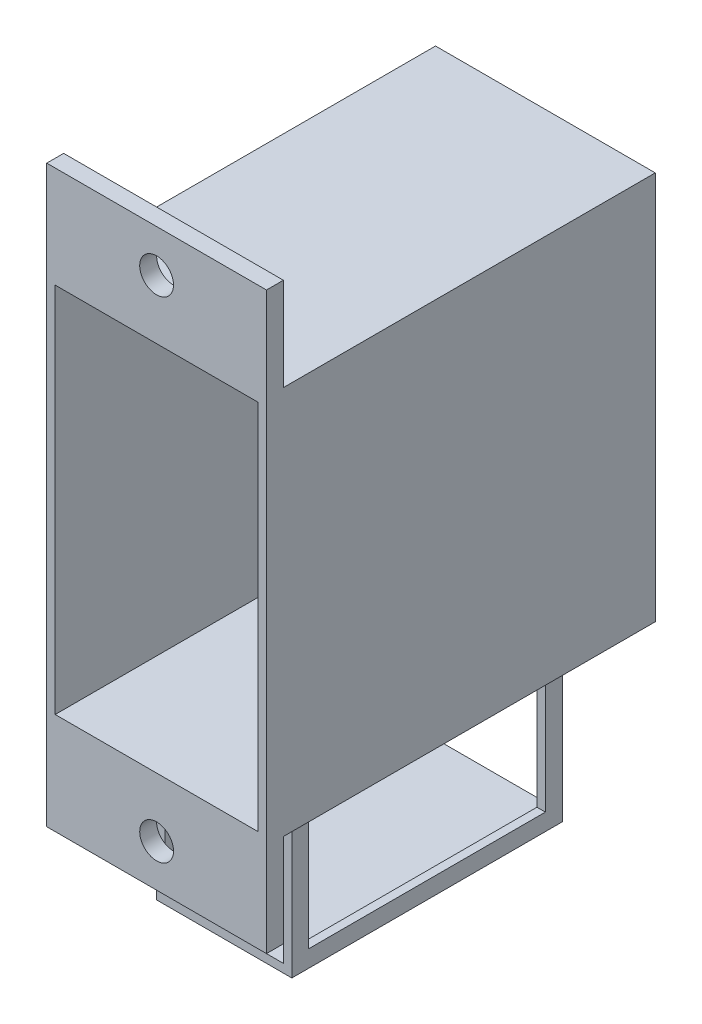
ISO-10303-21;
HEADER;
FILE_DESCRIPTION(('STEP AP214'),'2;1');
FILE_NAME('part.step','',(''),(''),'','','');
FILE_SCHEMA(('AUTOMOTIVE_DESIGN { 1 0 10303 214 1 1 1 1 }'));
ENDSEC;
DATA;
#1=APPLICATION_CONTEXT('core data for automotive mechanical design processes');
#2=APPLICATION_PROTOCOL_DEFINITION('international standard','automotive_design',2000,#1);
#3=PRODUCT_CONTEXT('',#1,'mechanical');
#4=PRODUCT('Part','Part','',(#3));
#5=PRODUCT_RELATED_PRODUCT_CATEGORY('part','',(#4));
#6=PRODUCT_DEFINITION_FORMATION('','',#4);
#7=PRODUCT_DEFINITION_CONTEXT('part definition',#1,'design');
#8=PRODUCT_DEFINITION('design','',#6,#7);
#9=PRODUCT_DEFINITION_SHAPE('','',#8);
#10=(LENGTH_UNIT() NAMED_UNIT(*) SI_UNIT(.MILLI.,.METRE.));
#11=(NAMED_UNIT(*) PLANE_ANGLE_UNIT() SI_UNIT($,.RADIAN.));
#12=(NAMED_UNIT(*) SI_UNIT($,.STERADIAN.) SOLID_ANGLE_UNIT());
#13=UNCERTAINTY_MEASURE_WITH_UNIT(LENGTH_MEASURE(1.E-05),#10,'distance_accuracy_value','');
#14=(GEOMETRIC_REPRESENTATION_CONTEXT(3) GLOBAL_UNCERTAINTY_ASSIGNED_CONTEXT((#13)) GLOBAL_UNIT_ASSIGNED_CONTEXT((#10,
#11,#12)) REPRESENTATION_CONTEXT('',''));
#15=CARTESIAN_POINT('',(0.,0.,0.));
#16=DIRECTION('',(0.,0.,1.));
#17=DIRECTION('',(1.,0.,0.));
#18=AXIS2_PLACEMENT_3D('',#15,#16,#17);
#19=CARTESIAN_POINT('',(-6.501,-20.5,4.));
#20=DIRECTION('',(0.,0.,-1.));
#21=DIRECTION('',(-1.,0.,0.));
#22=AXIS2_PLACEMENT_3D('',#19,#20,#21);
#23=PLANE('',#22);
#24=DIRECTION('',(1.,0.,0.));
#25=VECTOR('',#24,1.);
#26=CARTESIAN_POINT('',(-6.501,-12.5,4.));
#27=LINE('',#26,#25);
#28=CARTESIAN_POINT('',(3.5,-12.5,4.));
#29=VERTEX_POINT('',#28);
#30=CARTESIAN_POINT('',(4.,-12.5,4.));
#31=VERTEX_POINT('',#30);
#32=EDGE_CURVE('E265',#29,#31,#27,.T.);
#33=ORIENTED_EDGE('',*,*,#32,.F.);
#34=DIRECTION('',(0.,1.,0.));
#35=VECTOR('',#34,1.);
#36=CARTESIAN_POINT('',(3.5,-12.,4.));
#37=LINE('',#36,#35);
#38=CARTESIAN_POINT('',(3.5,-20.5,4.));
#39=VERTEX_POINT('',#38);
#40=EDGE_CURVE('E232',#39,#29,#37,.T.);
#41=ORIENTED_EDGE('',*,*,#40,.F.);
#42=DIRECTION('',(1.,0.,0.));
#43=VECTOR('',#42,1.);
#44=CARTESIAN_POINT('',(-6.501,-20.5,4.));
#45=LINE('',#44,#43);
#46=CARTESIAN_POINT('',(4.,-20.5,4.));
#47=VERTEX_POINT('',#46);
#48=EDGE_CURVE('E249',#39,#47,#45,.T.);
#49=ORIENTED_EDGE('',*,*,#48,.T.);
#50=DIRECTION('',(0.,1.,0.));
#51=VECTOR('',#50,1.);
#52=CARTESIAN_POINT('',(4.,-20.5,4.));
#53=LINE('',#52,#51);
#54=EDGE_CURVE('E537',#47,#31,#53,.T.);
#55=ORIENTED_EDGE('',*,*,#54,.T.);
#56=EDGE_LOOP('',(#33,#41,#49,#55));
#57=FACE_BOUND('',#56,.T.);
#58=ADVANCED_FACE('F36',(#57),#23,.F.);
#59=CARTESIAN_POINT('',(-6.501,-20.5,18.));
#60=DIRECTION('',(0.,-1.,0.));
#61=DIRECTION('',(0.,0.,-1.));
#62=AXIS2_PLACEMENT_3D('',#59,#60,#61);
#63=PLANE('',#62);
#64=ORIENTED_EDGE('',*,*,#48,.F.);
#65=DIRECTION('',(0.,0.,-1.));
#66=VECTOR('',#65,1.);
#67=CARTESIAN_POINT('',(3.5,-20.5,23.001));
#68=LINE('',#67,#66);
#69=CARTESIAN_POINT('',(3.5,-20.5,18.));
#70=VERTEX_POINT('',#69);
#71=EDGE_CURVE('E242',#70,#39,#68,.T.);
#72=ORIENTED_EDGE('',*,*,#71,.F.);
#73=DIRECTION('',(1.,0.,0.));
#74=VECTOR('',#73,1.);
#75=CARTESIAN_POINT('',(-6.501,-20.5,18.));
#76=LINE('',#75,#74);
#77=CARTESIAN_POINT('',(4.,-20.5,18.));
#78=VERTEX_POINT('',#77);
#79=EDGE_CURVE('E259',#70,#78,#76,.T.);
#80=ORIENTED_EDGE('',*,*,#79,.T.);
#81=DIRECTION('',(0.,0.,-1.));
#82=VECTOR('',#81,1.);
#83=CARTESIAN_POINT('',(4.,-20.5,18.));
#84=LINE('',#83,#82);
#85=EDGE_CURVE('E256',#78,#47,#84,.T.);
#86=ORIENTED_EDGE('',*,*,#85,.T.);
#87=EDGE_LOOP('',(#64,#72,#80,#86));
#88=FACE_BOUND('',#87,.T.);
#89=ADVANCED_FACE('F472',(#88),#63,.F.);
#90=CARTESIAN_POINT('',(-6.501,-20.5,18.));
#91=DIRECTION('',(0.,0.,1.));
#92=DIRECTION('',(1.,0.,0.));
#93=AXIS2_PLACEMENT_3D('',#90,#91,#92);
#94=PLANE('',#93);
#95=ORIENTED_EDGE('',*,*,#79,.F.);
#96=DIRECTION('',(0.,-1.,0.));
#97=VECTOR('',#96,1.);
#98=CARTESIAN_POINT('',(3.5,-12.,18.));
#99=LINE('',#98,#97);
#100=CARTESIAN_POINT('',(3.5,-12.5,18.));
#101=VERTEX_POINT('',#100);
#102=EDGE_CURVE('E517',#101,#70,#99,.T.);
#103=ORIENTED_EDGE('',*,*,#102,.F.);
#104=DIRECTION('',(1.,0.,0.));
#105=VECTOR('',#104,1.);
#106=CARTESIAN_POINT('',(-6.501,-12.5,18.));
#107=LINE('',#106,#105);
#108=CARTESIAN_POINT('',(4.,-12.5,18.));
#109=VERTEX_POINT('',#108);
#110=EDGE_CURVE('E263',#101,#109,#107,.T.);
#111=ORIENTED_EDGE('',*,*,#110,.T.);
#112=DIRECTION('',(0.,-1.,0.));
#113=VECTOR('',#112,1.);
#114=CARTESIAN_POINT('',(4.,-20.5,18.));
#115=LINE('',#114,#113);
#116=EDGE_CURVE('E542',#109,#78,#115,.T.);
#117=ORIENTED_EDGE('',*,*,#116,.T.);
#118=EDGE_LOOP('',(#95,#103,#111,#117));
#119=FACE_BOUND('',#118,.T.);
#120=ADVANCED_FACE('F478',(#119),#94,.F.);
#121=CARTESIAN_POINT('',(-6.501,-12.5,18.));
#122=DIRECTION('',(0.,1.,0.));
#123=DIRECTION('',(0.,0.,1.));
#124=AXIS2_PLACEMENT_3D('',#121,#122,#123);
#125=PLANE('',#124);
#126=ORIENTED_EDGE('',*,*,#110,.F.);
#127=DIRECTION('',(0.,0.,1.));
#128=VECTOR('',#127,1.);
#129=CARTESIAN_POINT('',(3.5,-12.5,23.001));
#130=LINE('',#129,#128);
#131=EDGE_CURVE('E519',#29,#101,#130,.T.);
#132=ORIENTED_EDGE('',*,*,#131,.F.);
#133=ORIENTED_EDGE('',*,*,#32,.T.);
#134=DIRECTION('',(0.,0.,1.));
#135=VECTOR('',#134,1.);
#136=CARTESIAN_POINT('',(4.,-12.5,18.));
#137=LINE('',#136,#135);
#138=EDGE_CURVE('E540',#31,#109,#137,.T.);
#139=ORIENTED_EDGE('',*,*,#138,.T.);
#140=EDGE_LOOP('',(#126,#132,#133,#139));
#141=FACE_BOUND('',#140,.T.);
#142=ADVANCED_FACE('F439',(#141),#125,.F.);
#143=CARTESIAN_POINT('',(-6.5,-11.5,23.));
#144=DIRECTION('',(0.,1.,0.));
#145=DIRECTION('',(0.,0.,1.));
#146=AXIS2_PLACEMENT_3D('',#143,#144,#145);
#147=PLANE('',#146);
#148=DIRECTION('',(0.,0.,-1.));
#149=VECTOR('',#148,1.);
#150=CARTESIAN_POINT('',(6.5,-11.5,23.));
#151=LINE('',#150,#149);
#152=CARTESIAN_POINT('',(6.5,-11.5,22.));
#153=VERTEX_POINT('',#152);
#154=CARTESIAN_POINT('',(6.5,-11.5,0.));
#155=VERTEX_POINT('',#154);
#156=EDGE_CURVE('E401',#153,#155,#151,.T.);
#157=ORIENTED_EDGE('',*,*,#156,.F.);
#158=DIRECTION('',(-1.,0.,0.));
#159=VECTOR('',#158,1.);
#160=CARTESIAN_POINT('',(6.5,-11.5,22.));
#161=LINE('',#160,#159);
#162=CARTESIAN_POINT('',(-6.5,-11.5,22.));
#163=VERTEX_POINT('',#162);
#164=EDGE_CURVE('E312',#153,#163,#161,.T.);
#165=ORIENTED_EDGE('',*,*,#164,.T.);
#166=DIRECTION('',(0.,0.,-1.));
#167=VECTOR('',#166,1.);
#168=CARTESIAN_POINT('',(-6.5,-11.5,23.));
#169=LINE('',#168,#167);
#170=CARTESIAN_POINT('',(-6.5,-11.5,0.));
#171=VERTEX_POINT('',#170);
#172=EDGE_CURVE('E45',#163,#171,#169,.T.);
#173=ORIENTED_EDGE('',*,*,#172,.T.);
#174=DIRECTION('',(1.,0.,0.));
#175=VECTOR('',#174,1.);
#176=CARTESIAN_POINT('',(-6.5,-11.5,0.));
#177=LINE('',#176,#175);
#178=EDGE_CURVE('E396',#171,#155,#177,.T.);
#179=ORIENTED_EDGE('',*,*,#178,.T.);
#180=EDGE_LOOP('',(#157,#165,#173,#179));
#181=FACE_BOUND('',#180,.T.);
#182=DIRECTION('',(0.,0.,1.));
#183=VECTOR('',#182,1.);
#184=CARTESIAN_POINT('',(4.,-11.5,19.));
#185=LINE('',#184,#183);
#186=CARTESIAN_POINT('',(4.,-11.5,3.));
#187=VERTEX_POINT('',#186);
#188=CARTESIAN_POINT('',(4.,-11.5,19.));
#189=VERTEX_POINT('',#188);
#190=EDGE_CURVE('E252',#187,#189,#185,.T.);
#191=ORIENTED_EDGE('',*,*,#190,.F.);
#192=DIRECTION('',(1.,0.,0.));
#193=VECTOR('',#192,1.);
#194=CARTESIAN_POINT('',(-4.,-11.5,3.));
#195=LINE('',#194,#193);
#196=CARTESIAN_POINT('',(-4.,-11.5,3.));
#197=VERTEX_POINT('',#196);
#198=EDGE_CURVE('E271',#197,#187,#195,.T.);
#199=ORIENTED_EDGE('',*,*,#198,.F.);
#200=DIRECTION('',(0.,0.,-1.));
#201=VECTOR('',#200,1.);
#202=CARTESIAN_POINT('',(-4.,-11.5,19.));
#203=LINE('',#202,#201);
#204=CARTESIAN_POINT('',(-4.,-11.5,19.));
#205=VERTEX_POINT('',#204);
#206=EDGE_CURVE('E283',#205,#197,#203,.T.);
#207=ORIENTED_EDGE('',*,*,#206,.F.);
#208=DIRECTION('',(-1.,0.,0.));
#209=VECTOR('',#208,1.);
#210=CARTESIAN_POINT('',(-4.,-11.5,19.));
#211=LINE('',#210,#209);
#212=EDGE_CURVE('E280',#189,#205,#211,.T.);
#213=ORIENTED_EDGE('',*,*,#212,.F.);
#214=EDGE_LOOP('',(#191,#199,#207,#213));
#215=FACE_BOUND('',#214,.T.);
#216=ADVANCED_FACE('F436',(#181,#215),#147,.F.);
#217=CARTESIAN_POINT('',(-6.5,11.5,23.));
#218=DIRECTION('',(0.,1.,0.));
#219=DIRECTION('',(0.,0.,1.));
#220=AXIS2_PLACEMENT_3D('',#217,#218,#219);
#221=PLANE('',#220);
#222=DIRECTION('',(0.,0.,-1.));
#223=VECTOR('',#222,1.);
#224=CARTESIAN_POINT('',(-6.5,11.5,23.));
#225=LINE('',#224,#223);
#226=CARTESIAN_POINT('',(-6.5,11.5,22.));
#227=VERTEX_POINT('',#226);
#228=CARTESIAN_POINT('',(-6.5,11.5,0.));
#229=VERTEX_POINT('',#228);
#230=EDGE_CURVE('E11',#227,#229,#225,.T.);
#231=ORIENTED_EDGE('',*,*,#230,.F.);
#232=DIRECTION('',(1.,0.,0.));
#233=VECTOR('',#232,1.);
#234=CARTESIAN_POINT('',(6.5,11.5,22.));
#235=LINE('',#234,#233);
#236=CARTESIAN_POINT('',(6.5,11.5,22.));
#237=VERTEX_POINT('',#236);
#238=EDGE_CURVE('E333',#227,#237,#235,.T.);
#239=ORIENTED_EDGE('',*,*,#238,.T.);
#240=DIRECTION('',(0.,0.,-1.));
#241=VECTOR('',#240,1.);
#242=CARTESIAN_POINT('',(6.5,11.5,23.));
#243=LINE('',#242,#241);
#244=CARTESIAN_POINT('',(6.5,11.5,0.));
#245=VERTEX_POINT('',#244);
#246=EDGE_CURVE('E40',#237,#245,#243,.T.);
#247=ORIENTED_EDGE('',*,*,#246,.T.);
#248=DIRECTION('',(1.,0.,0.));
#249=VECTOR('',#248,1.);
#250=CARTESIAN_POINT('',(-6.5,11.5,0.));
#251=LINE('',#250,#249);
#252=EDGE_CURVE('E385',#229,#245,#251,.T.);
#253=ORIENTED_EDGE('',*,*,#252,.F.);
#254=EDGE_LOOP('',(#231,#239,#247,#253));
#255=FACE_BOUND('',#254,.T.);
#256=ADVANCED_FACE('F38',(#255),#221,.T.);
#257=CARTESIAN_POINT('',(0.,0.,23.));
#258=DIRECTION('',(0.,0.,-1.));
#259=DIRECTION('',(-1.,0.,0.));
#260=AXIS2_PLACEMENT_3D('',#257,#258,#259);
#261=PLANE('',#260);
#262=DIRECTION('',(0.,-1.,0.));
#263=VECTOR('',#262,1.);
#264=CARTESIAN_POINT('',(6.5,11.5,23.));
#265=LINE('',#264,#263);
#266=CARTESIAN_POINT('',(6.5,17.,23.));
#267=VERTEX_POINT('',#266);
#268=CARTESIAN_POINT('',(6.5,-17.,23.));
#269=VERTEX_POINT('',#268);
#270=EDGE_CURVE('E386',#267,#269,#265,.T.);
#271=ORIENTED_EDGE('',*,*,#270,.F.);
#272=DIRECTION('',(-1.,0.,0.));
#273=VECTOR('',#272,1.);
#274=CARTESIAN_POINT('',(-6.5,17.,23.));
#275=LINE('',#274,#273);
#276=CARTESIAN_POINT('',(-6.5,17.,23.));
#277=VERTEX_POINT('',#276);
#278=EDGE_CURVE('E330',#267,#277,#275,.T.);
#279=ORIENTED_EDGE('',*,*,#278,.T.);
#280=DIRECTION('',(0.,-1.,0.));
#281=VECTOR('',#280,1.);
#282=CARTESIAN_POINT('',(-6.5,11.5,23.));
#283=LINE('',#282,#281);
#284=CARTESIAN_POINT('',(-6.5,-17.,23.));
#285=VERTEX_POINT('',#284);
#286=EDGE_CURVE('E388',#277,#285,#283,.T.);
#287=ORIENTED_EDGE('',*,*,#286,.T.);
#288=DIRECTION('',(1.,0.,0.));
#289=VECTOR('',#288,1.);
#290=CARTESIAN_POINT('',(-6.5,-17.,23.));
#291=LINE('',#290,#289);
#292=EDGE_CURVE('E303',#285,#269,#291,.T.);
#293=ORIENTED_EDGE('',*,*,#292,.T.);
#294=EDGE_LOOP('',(#271,#279,#287,#293));
#295=FACE_BOUND('',#294,.T.);
#296=DIRECTION('',(0.,1.,0.));
#297=VECTOR('',#296,1.);
#298=CARTESIAN_POINT('',(-6.,11.,23.));
#299=LINE('',#298,#297);
#300=CARTESIAN_POINT('',(-6.,-11.,23.));
#301=VERTEX_POINT('',#300);
#302=CARTESIAN_POINT('',(-6.,11.,23.));
#303=VERTEX_POINT('',#302);
#304=EDGE_CURVE('E358',#301,#303,#299,.T.);
#305=ORIENTED_EDGE('',*,*,#304,.T.);
#306=DIRECTION('',(-1.,0.,0.));
#307=VECTOR('',#306,1.);
#308=CARTESIAN_POINT('',(-6.,11.,23.));
#309=LINE('',#308,#307);
#310=CARTESIAN_POINT('',(6.,11.,23.));
#311=VERTEX_POINT('',#310);
#312=EDGE_CURVE('E382',#311,#303,#309,.T.);
#313=ORIENTED_EDGE('',*,*,#312,.F.);
#314=DIRECTION('',(0.,1.,0.));
#315=VECTOR('',#314,1.);
#316=CARTESIAN_POINT('',(6.,11.,23.));
#317=LINE('',#316,#315);
#318=CARTESIAN_POINT('',(6.,-11.,23.));
#319=VERTEX_POINT('',#318);
#320=EDGE_CURVE('E351',#319,#311,#317,.T.);
#321=ORIENTED_EDGE('',*,*,#320,.F.);
#322=DIRECTION('',(-1.,0.,0.));
#323=VECTOR('',#322,1.);
#324=CARTESIAN_POINT('',(-6.,-11.,23.));
#325=LINE('',#324,#323);
#326=EDGE_CURVE('E355',#319,#301,#325,.T.);
#327=ORIENTED_EDGE('',*,*,#326,.T.);
#328=EDGE_LOOP('',(#305,#313,#321,#327));
#329=FACE_BOUND('',#328,.T.);
#330=CARTESIAN_POINT('',(0.,14.5,23.));
#331=DIRECTION('',(0.,0.,1.));
#332=DIRECTION('',(1.,0.,0.));
#333=AXIS2_PLACEMENT_3D('',#330,#331,#332);
#334=CIRCLE('',#333,1.);
#335=CARTESIAN_POINT('',(1.,14.5,23.));
#336=VERTEX_POINT('',#335);
#337=EDGE_CURVE('E324',#336,#336,#334,.T.);
#338=ORIENTED_EDGE('',*,*,#337,.F.);
#339=EDGE_LOOP('',(#338));
#340=FACE_BOUND('',#339,.T.);
#341=CARTESIAN_POINT('',(0.,-14.5,23.));
#342=DIRECTION('',(0.,0.,1.));
#343=DIRECTION('',(-1.,0.,0.));
#344=AXIS2_PLACEMENT_3D('',#341,#342,#343);
#345=CIRCLE('',#344,1.);
#346=CARTESIAN_POINT('',(-1.,-14.5,23.));
#347=VERTEX_POINT('',#346);
#348=EDGE_CURVE('E299',#347,#347,#345,.T.);
#349=ORIENTED_EDGE('',*,*,#348,.F.);
#350=EDGE_LOOP('',(#349));
#351=FACE_BOUND('',#350,.T.);
#352=ADVANCED_FACE('F426',(#295,#329,#340,#351),#261,.F.);
#353=CARTESIAN_POINT('',(0.,0.,0.));
#354=DIRECTION('',(0.,0.,-1.));
#355=DIRECTION('',(-1.,0.,0.));
#356=AXIS2_PLACEMENT_3D('',#353,#354,#355);
#357=PLANE('',#356);
#358=ORIENTED_EDGE('',*,*,#252,.T.);
#359=DIRECTION('',(0.,-1.,0.));
#360=VECTOR('',#359,1.);
#361=CARTESIAN_POINT('',(6.5,11.5,0.));
#362=LINE('',#361,#360);
#363=EDGE_CURVE('E393',#245,#155,#362,.T.);
#364=ORIENTED_EDGE('',*,*,#363,.T.);
#365=ORIENTED_EDGE('',*,*,#178,.F.);
#366=DIRECTION('',(0.,-1.,0.));
#367=VECTOR('',#366,1.);
#368=CARTESIAN_POINT('',(-6.5,11.5,0.));
#369=LINE('',#368,#367);
#370=EDGE_CURVE('E389',#229,#171,#369,.T.);
#371=ORIENTED_EDGE('',*,*,#370,.F.);
#372=EDGE_LOOP('',(#358,#364,#365,#371));
#373=FACE_BOUND('',#372,.T.);
#374=DIRECTION('',(1.,0.,0.));
#375=VECTOR('',#374,1.);
#376=CARTESIAN_POINT('',(-6.,11.,0.));
#377=LINE('',#376,#375);
#378=CARTESIAN_POINT('',(-6.,11.,0.));
#379=VERTEX_POINT('',#378);
#380=CARTESIAN_POINT('',(6.,11.,0.));
#381=VERTEX_POINT('',#380);
#382=EDGE_CURVE('E370',#379,#381,#377,.T.);
#383=ORIENTED_EDGE('',*,*,#382,.F.);
#384=DIRECTION('',(0.,-1.,0.));
#385=VECTOR('',#384,1.);
#386=CARTESIAN_POINT('',(-6.,11.,0.));
#387=LINE('',#386,#385);
#388=CARTESIAN_POINT('',(-6.,-11.,0.));
#389=VERTEX_POINT('',#388);
#390=EDGE_CURVE('E361',#379,#389,#387,.T.);
#391=ORIENTED_EDGE('',*,*,#390,.T.);
#392=DIRECTION('',(1.,0.,0.));
#393=VECTOR('',#392,1.);
#394=CARTESIAN_POINT('',(-6.,-11.,0.));
#395=LINE('',#394,#393);
#396=CARTESIAN_POINT('',(6.,-11.,0.));
#397=VERTEX_POINT('',#396);
#398=EDGE_CURVE('E364',#389,#397,#395,.T.);
#399=ORIENTED_EDGE('',*,*,#398,.T.);
#400=DIRECTION('',(0.,-1.,0.));
#401=VECTOR('',#400,1.);
#402=CARTESIAN_POINT('',(6.,11.,0.));
#403=LINE('',#402,#401);
#404=EDGE_CURVE('E367',#381,#397,#403,.T.);
#405=ORIENTED_EDGE('',*,*,#404,.F.);
#406=EDGE_LOOP('',(#383,#391,#399,#405));
#407=FACE_BOUND('',#406,.T.);
#408=ADVANCED_FACE('F413',(#373,#407),#357,.T.);
#409=CARTESIAN_POINT('',(-6.5,11.5,23.));
#410=DIRECTION('',(1.,0.,0.));
#411=DIRECTION('',(0.,1.,0.));
#412=AXIS2_PLACEMENT_3D('',#409,#410,#411);
#413=PLANE('',#412);
#414=ORIENTED_EDGE('',*,*,#370,.T.);
#415=ORIENTED_EDGE('',*,*,#172,.F.);
#416=DIRECTION('',(0.,-1.,0.));
#417=VECTOR('',#416,1.);
#418=CARTESIAN_POINT('',(-6.49999999999999,-11.5,22.));
#419=LINE('',#418,#417);
#420=CARTESIAN_POINT('',(-6.5,-17.,22.));
#421=VERTEX_POINT('',#420);
#422=EDGE_CURVE('E315',#163,#421,#419,.T.);
#423=ORIENTED_EDGE('',*,*,#422,.T.);
#424=DIRECTION('',(0.,0.,1.));
#425=VECTOR('',#424,1.);
#426=CARTESIAN_POINT('',(-6.5,-17.,22.));
#427=LINE('',#426,#425);
#428=EDGE_CURVE('E321',#421,#285,#427,.T.);
#429=ORIENTED_EDGE('',*,*,#428,.T.);
#430=ORIENTED_EDGE('',*,*,#286,.F.);
#431=DIRECTION('',(0.,0.,1.));
#432=VECTOR('',#431,1.);
#433=CARTESIAN_POINT('',(-6.5,17.,22.));
#434=LINE('',#433,#432);
#435=CARTESIAN_POINT('',(-6.5,17.,22.));
#436=VERTEX_POINT('',#435);
#437=EDGE_CURVE('E348',#436,#277,#434,.T.);
#438=ORIENTED_EDGE('',*,*,#437,.F.);
#439=DIRECTION('',(0.,-1.,0.));
#440=VECTOR('',#439,1.);
#441=CARTESIAN_POINT('',(-6.5,11.5,22.));
#442=LINE('',#441,#440);
#443=EDGE_CURVE('E342',#436,#227,#442,.T.);
#444=ORIENTED_EDGE('',*,*,#443,.T.);
#445=ORIENTED_EDGE('',*,*,#230,.T.);
#446=EDGE_LOOP('',(#414,#415,#423,#429,#430,#438,#444,#445));
#447=FACE_BOUND('',#446,.T.);
#448=ADVANCED_FACE('F417',(#447),#413,.F.);
#449=CARTESIAN_POINT('',(6.5,11.5,23.));
#450=DIRECTION('',(1.,0.,0.));
#451=DIRECTION('',(0.,1.,0.));
#452=AXIS2_PLACEMENT_3D('',#449,#450,#451);
#453=PLANE('',#452);
#454=ORIENTED_EDGE('',*,*,#363,.F.);
#455=ORIENTED_EDGE('',*,*,#246,.F.);
#456=DIRECTION('',(0.,1.,0.));
#457=VECTOR('',#456,1.);
#458=CARTESIAN_POINT('',(6.5,17.,22.));
#459=LINE('',#458,#457);
#460=CARTESIAN_POINT('',(6.5,17.,22.));
#461=VERTEX_POINT('',#460);
#462=EDGE_CURVE('E336',#237,#461,#459,.T.);
#463=ORIENTED_EDGE('',*,*,#462,.T.);
#464=DIRECTION('',(0.,0.,1.));
#465=VECTOR('',#464,1.);
#466=CARTESIAN_POINT('',(6.5,17.,22.));
#467=LINE('',#466,#465);
#468=EDGE_CURVE('E345',#461,#267,#467,.T.);
#469=ORIENTED_EDGE('',*,*,#468,.T.);
#470=ORIENTED_EDGE('',*,*,#270,.T.);
#471=DIRECTION('',(0.,0.,1.));
#472=VECTOR('',#471,1.);
#473=CARTESIAN_POINT('',(6.5,-17.,22.));
#474=LINE('',#473,#472);
#475=CARTESIAN_POINT('',(6.5,-17.,22.));
#476=VERTEX_POINT('',#475);
#477=EDGE_CURVE('E318',#476,#269,#474,.T.);
#478=ORIENTED_EDGE('',*,*,#477,.F.);
#479=DIRECTION('',(0.,1.,0.));
#480=VECTOR('',#479,1.);
#481=CARTESIAN_POINT('',(6.5,-17.,22.));
#482=LINE('',#481,#480);
#483=EDGE_CURVE('E309',#476,#153,#482,.T.);
#484=ORIENTED_EDGE('',*,*,#483,.T.);
#485=ORIENTED_EDGE('',*,*,#156,.T.);
#486=EDGE_LOOP('',(#454,#455,#463,#469,#470,#478,#484,#485));
#487=FACE_BOUND('',#486,.T.);
#488=ADVANCED_FACE('F409',(#487),#453,.T.);
#489=CARTESIAN_POINT('',(-6.,11.,23.001));
#490=DIRECTION('',(1.,0.,0.));
#491=DIRECTION('',(0.,1.,0.));
#492=AXIS2_PLACEMENT_3D('',#489,#490,#491);
#493=PLANE('',#492);
#494=DIRECTION('',(0.,0.,-1.));
#495=VECTOR('',#494,1.);
#496=CARTESIAN_POINT('',(-6.,-11.,23.001));
#497=LINE('',#496,#495);
#498=EDGE_CURVE('E380',#301,#389,#497,.T.);
#499=ORIENTED_EDGE('',*,*,#498,.T.);
#500=ORIENTED_EDGE('',*,*,#390,.F.);
#501=DIRECTION('',(0.,0.,-1.));
#502=VECTOR('',#501,1.);
#503=CARTESIAN_POINT('',(-6.,11.,23.001));
#504=LINE('',#503,#502);
#505=EDGE_CURVE('E373',#303,#379,#504,.T.);
#506=ORIENTED_EDGE('',*,*,#505,.F.);
#507=ORIENTED_EDGE('',*,*,#304,.F.);
#508=EDGE_LOOP('',(#499,#500,#506,#507));
#509=FACE_BOUND('',#508,.T.);
#510=ADVANCED_FACE('F627',(#509),#493,.T.);
#511=CARTESIAN_POINT('',(-6.,-11.,23.001));
#512=DIRECTION('',(0.,1.,0.));
#513=DIRECTION('',(0.,0.,1.));
#514=AXIS2_PLACEMENT_3D('',#511,#512,#513);
#515=PLANE('',#514);
#516=DIRECTION('',(0.,0.,-1.));
#517=VECTOR('',#516,1.);
#518=CARTESIAN_POINT('',(6.,-11.,23.001));
#519=LINE('',#518,#517);
#520=EDGE_CURVE('E378',#319,#397,#519,.T.);
#521=ORIENTED_EDGE('',*,*,#520,.T.);
#522=ORIENTED_EDGE('',*,*,#398,.F.);
#523=ORIENTED_EDGE('',*,*,#498,.F.);
#524=ORIENTED_EDGE('',*,*,#326,.F.);
#525=EDGE_LOOP('',(#521,#522,#523,#524));
#526=FACE_BOUND('',#525,.T.);
#527=ADVANCED_FACE('F633',(#526),#515,.T.);
#528=CARTESIAN_POINT('',(6.,11.,23.001));
#529=DIRECTION('',(1.,0.,0.));
#530=DIRECTION('',(0.,1.,0.));
#531=AXIS2_PLACEMENT_3D('',#528,#529,#530);
#532=PLANE('',#531);
#533=ORIENTED_EDGE('',*,*,#320,.T.);
#534=DIRECTION('',(0.,0.,-1.));
#535=VECTOR('',#534,1.);
#536=CARTESIAN_POINT('',(6.,11.,23.001));
#537=LINE('',#536,#535);
#538=EDGE_CURVE('E376',#311,#381,#537,.T.);
#539=ORIENTED_EDGE('',*,*,#538,.T.);
#540=ORIENTED_EDGE('',*,*,#404,.T.);
#541=ORIENTED_EDGE('',*,*,#520,.F.);
#542=EDGE_LOOP('',(#533,#539,#540,#541));
#543=FACE_BOUND('',#542,.T.);
#544=ADVANCED_FACE('F641',(#543),#532,.F.);
#545=CARTESIAN_POINT('',(-6.,11.,23.001));
#546=DIRECTION('',(0.,1.,0.));
#547=DIRECTION('',(0.,0.,1.));
#548=AXIS2_PLACEMENT_3D('',#545,#546,#547);
#549=PLANE('',#548);
#550=ORIENTED_EDGE('',*,*,#312,.T.);
#551=ORIENTED_EDGE('',*,*,#505,.T.);
#552=ORIENTED_EDGE('',*,*,#382,.T.);
#553=ORIENTED_EDGE('',*,*,#538,.F.);
#554=EDGE_LOOP('',(#550,#551,#552,#553));
#555=FACE_BOUND('',#554,.T.);
#556=ADVANCED_FACE('F649',(#555),#549,.F.);
#557=CARTESIAN_POINT('',(-6.5,17.,22.));
#558=DIRECTION('',(0.,1.,0.));
#559=DIRECTION('',(0.,0.,1.));
#560=AXIS2_PLACEMENT_3D('',#557,#558,#559);
#561=PLANE('',#560);
#562=ORIENTED_EDGE('',*,*,#278,.F.);
#563=ORIENTED_EDGE('',*,*,#468,.F.);
#564=DIRECTION('',(-1.,0.,0.));
#565=VECTOR('',#564,1.);
#566=CARTESIAN_POINT('',(-6.5,17.,22.));
#567=LINE('',#566,#565);
#568=EDGE_CURVE('E339',#461,#436,#567,.T.);
#569=ORIENTED_EDGE('',*,*,#568,.T.);
#570=ORIENTED_EDGE('',*,*,#437,.T.);
#571=EDGE_LOOP('',(#562,#563,#569,#570));
#572=FACE_BOUND('',#571,.T.);
#573=ADVANCED_FACE('F424',(#572),#561,.T.);
#574=CARTESIAN_POINT('',(0.,0.,22.));
#575=DIRECTION('',(0.,0.,-1.));
#576=DIRECTION('',(-1.,0.,0.));
#577=AXIS2_PLACEMENT_3D('',#574,#575,#576);
#578=PLANE('',#577);
#579=CARTESIAN_POINT('',(0.,14.5,22.));
#580=DIRECTION('',(0.,0.,1.));
#581=DIRECTION('',(1.,0.,0.));
#582=AXIS2_PLACEMENT_3D('',#579,#580,#581);
#583=CIRCLE('',#582,1.);
#584=CARTESIAN_POINT('',(1.,14.5,22.));
#585=VERTEX_POINT('',#584);
#586=EDGE_CURVE('E327',#585,#585,#583,.T.);
#587=ORIENTED_EDGE('',*,*,#586,.T.);
#588=EDGE_LOOP('',(#587));
#589=FACE_BOUND('',#588,.T.);
#590=ORIENTED_EDGE('',*,*,#238,.F.);
#591=ORIENTED_EDGE('',*,*,#443,.F.);
#592=ORIENTED_EDGE('',*,*,#568,.F.);
#593=ORIENTED_EDGE('',*,*,#462,.F.);
#594=EDGE_LOOP('',(#590,#591,#592,#593));
#595=FACE_BOUND('',#594,.T.);
#596=ADVANCED_FACE('F421',(#589,#595),#578,.T.);
#597=CARTESIAN_POINT('',(0.,14.5,22.));
#598=DIRECTION('',(0.,0.,1.));
#599=DIRECTION('',(1.,0.,0.));
#600=AXIS2_PLACEMENT_3D('',#597,#598,#599);
#601=CYLINDRICAL_SURFACE('',#600,1.);
#602=ORIENTED_EDGE('',*,*,#586,.F.);
#603=EDGE_LOOP('',(#602));
#604=FACE_BOUND('',#603,.T.);
#605=ORIENTED_EDGE('',*,*,#337,.T.);
#606=EDGE_LOOP('',(#605));
#607=FACE_BOUND('',#606,.T.);
#608=ADVANCED_FACE('F668',(#604,#607),#601,.F.);
#609=CARTESIAN_POINT('',(-6.5,-17.,22.));
#610=DIRECTION('',(0.,-1.,0.));
#611=DIRECTION('',(0.,0.,-1.));
#612=AXIS2_PLACEMENT_3D('',#609,#610,#611);
#613=PLANE('',#612);
#614=ORIENTED_EDGE('',*,*,#292,.F.);
#615=ORIENTED_EDGE('',*,*,#428,.F.);
#616=DIRECTION('',(1.,0.,0.));
#617=VECTOR('',#616,1.);
#618=CARTESIAN_POINT('',(-6.5,-17.,22.));
#619=LINE('',#618,#617);
#620=EDGE_CURVE('E306',#421,#476,#619,.T.);
#621=ORIENTED_EDGE('',*,*,#620,.T.);
#622=ORIENTED_EDGE('',*,*,#477,.T.);
#623=EDGE_LOOP('',(#614,#615,#621,#622));
#624=FACE_BOUND('',#623,.T.);
#625=ADVANCED_FACE('F430',(#624),#613,.T.);
#626=CARTESIAN_POINT('',(0.,0.,22.));
#627=DIRECTION('',(0.,0.,1.));
#628=DIRECTION('',(1.,0.,0.));
#629=AXIS2_PLACEMENT_3D('',#626,#627,#628);
#630=PLANE('',#629);
#631=CARTESIAN_POINT('',(0.,-14.5,22.));
#632=DIRECTION('',(0.,0.,1.));
#633=DIRECTION('',(-1.,0.,0.));
#634=AXIS2_PLACEMENT_3D('',#631,#632,#633);
#635=CIRCLE('',#634,1.);
#636=CARTESIAN_POINT('',(-1.,-14.5,22.));
#637=VERTEX_POINT('',#636);
#638=EDGE_CURVE('E300',#637,#637,#635,.T.);
#639=ORIENTED_EDGE('',*,*,#638,.T.);
#640=EDGE_LOOP('',(#639));
#641=FACE_BOUND('',#640,.T.);
#642=ORIENTED_EDGE('',*,*,#620,.F.);
#643=ORIENTED_EDGE('',*,*,#422,.F.);
#644=ORIENTED_EDGE('',*,*,#164,.F.);
#645=ORIENTED_EDGE('',*,*,#483,.F.);
#646=EDGE_LOOP('',(#642,#643,#644,#645));
#647=FACE_BOUND('',#646,.T.);
#648=ADVANCED_FACE('F434',(#641,#647),#630,.F.);
#649=CARTESIAN_POINT('',(0.,-14.5,22.));
#650=DIRECTION('',(0.,0.,1.));
#651=DIRECTION('',(1.,0.,0.));
#652=AXIS2_PLACEMENT_3D('',#649,#650,#651);
#653=CYLINDRICAL_SURFACE('',#652,1.);
#654=ORIENTED_EDGE('',*,*,#638,.F.);
#655=EDGE_LOOP('',(#654));
#656=FACE_BOUND('',#655,.T.);
#657=ORIENTED_EDGE('',*,*,#348,.T.);
#658=EDGE_LOOP('',(#657));
#659=FACE_BOUND('',#658,.T.);
#660=ADVANCED_FACE('F467',(#656,#659),#653,.F.);
#661=CARTESIAN_POINT('',(4.,-21.5,19.));
#662=DIRECTION('',(-1.,0.,0.));
#663=DIRECTION('',(0.,0.,1.));
#664=AXIS2_PLACEMENT_3D('',#661,#662,#663);
#665=PLANE('',#664);
#666=ORIENTED_EDGE('',*,*,#138,.F.);
#667=ORIENTED_EDGE('',*,*,#54,.F.);
#668=ORIENTED_EDGE('',*,*,#85,.F.);
#669=ORIENTED_EDGE('',*,*,#116,.F.);
#670=EDGE_LOOP('',(#666,#667,#668,#669));
#671=FACE_BOUND('',#670,.T.);
#672=ORIENTED_EDGE('',*,*,#190,.T.);
#673=DIRECTION('',(0.,1.,0.));
#674=VECTOR('',#673,1.);
#675=CARTESIAN_POINT('',(4.,-21.5,19.));
#676=LINE('',#675,#674);
#677=CARTESIAN_POINT('',(4.,-21.5,19.));
#678=VERTEX_POINT('',#677);
#679=EDGE_CURVE('E296',#678,#189,#676,.T.);
#680=ORIENTED_EDGE('',*,*,#679,.F.);
#681=DIRECTION('',(0.,0.,1.));
#682=VECTOR('',#681,1.);
#683=CARTESIAN_POINT('',(4.,-21.5,19.));
#684=LINE('',#683,#682);
#685=CARTESIAN_POINT('',(4.,-21.5,3.));
#686=VERTEX_POINT('',#685);
#687=EDGE_CURVE('E267',#686,#678,#684,.T.);
#688=ORIENTED_EDGE('',*,*,#687,.F.);
#689=DIRECTION('',(0.,1.,0.));
#690=VECTOR('',#689,1.);
#691=CARTESIAN_POINT('',(4.,-21.5,3.));
#692=LINE('',#691,#690);
#693=EDGE_CURVE('E277',#686,#187,#692,.T.);
#694=ORIENTED_EDGE('',*,*,#693,.T.);
#695=EDGE_LOOP('',(#672,#680,#688,#694));
#696=FACE_BOUND('',#695,.T.);
#697=ADVANCED_FACE('F449',(#671,#696),#665,.F.);
#698=CARTESIAN_POINT('',(-4.,-21.5,19.));
#699=DIRECTION('',(0.,0.,-1.));
#700=DIRECTION('',(-1.,0.,0.));
#701=AXIS2_PLACEMENT_3D('',#698,#699,#700);
#702=PLANE('',#701);
#703=DIRECTION('',(0.,-1.,0.));
#704=VECTOR('',#703,1.);
#705=CARTESIAN_POINT('',(-3.5,-12.,19.));
#706=LINE('',#705,#704);
#707=CARTESIAN_POINT('',(-3.5,-12.,19.));
#708=VERTEX_POINT('',#707);
#709=CARTESIAN_POINT('',(-3.5,-21.,19.));
#710=VERTEX_POINT('',#709);
#711=EDGE_CURVE('E520',#708,#710,#706,.T.);
#712=ORIENTED_EDGE('',*,*,#711,.F.);
#713=DIRECTION('',(-1.,0.,0.));
#714=VECTOR('',#713,1.);
#715=CARTESIAN_POINT('',(3.5,-12.,19.));
#716=LINE('',#715,#714);
#717=CARTESIAN_POINT('',(3.5,-12.,19.));
#718=VERTEX_POINT('',#717);
#719=EDGE_CURVE('E53',#718,#708,#716,.T.);
#720=ORIENTED_EDGE('',*,*,#719,.F.);
#721=DIRECTION('',(0.,1.,0.));
#722=VECTOR('',#721,1.);
#723=CARTESIAN_POINT('',(3.5,-12.,19.));
#724=LINE('',#723,#722);
#725=CARTESIAN_POINT('',(3.5,-21.,19.));
#726=VERTEX_POINT('',#725);
#727=EDGE_CURVE('E513',#726,#718,#724,.T.);
#728=ORIENTED_EDGE('',*,*,#727,.F.);
#729=DIRECTION('',(1.,0.,0.));
#730=VECTOR('',#729,1.);
#731=CARTESIAN_POINT('',(3.5,-21.,19.));
#732=LINE('',#731,#730);
#733=EDGE_CURVE('E523',#710,#726,#732,.T.);
#734=ORIENTED_EDGE('',*,*,#733,.F.);
#735=EDGE_LOOP('',(#712,#720,#728,#734));
#736=FACE_BOUND('',#735,.T.);
#737=ORIENTED_EDGE('',*,*,#212,.T.);
#738=DIRECTION('',(0.,1.,0.));
#739=VECTOR('',#738,1.);
#740=CARTESIAN_POINT('',(-4.,-21.5,19.));
#741=LINE('',#740,#739);
#742=CARTESIAN_POINT('',(-4.,-21.5,19.));
#743=VERTEX_POINT('',#742);
#744=EDGE_CURVE('E293',#743,#205,#741,.T.);
#745=ORIENTED_EDGE('',*,*,#744,.F.);
#746=DIRECTION('',(-1.,0.,0.));
#747=VECTOR('',#746,1.);
#748=CARTESIAN_POINT('',(-4.,-21.5,19.));
#749=LINE('',#748,#747);
#750=EDGE_CURVE('E270',#678,#743,#749,.T.);
#751=ORIENTED_EDGE('',*,*,#750,.F.);
#752=ORIENTED_EDGE('',*,*,#679,.T.);
#753=EDGE_LOOP('',(#737,#745,#751,#752));
#754=FACE_BOUND('',#753,.T.);
#755=ADVANCED_FACE('F457',(#736,#754),#702,.F.);
#756=CARTESIAN_POINT('',(-4.,-21.5,19.));
#757=DIRECTION('',(1.,0.,0.));
#758=DIRECTION('',(0.,0.,-1.));
#759=AXIS2_PLACEMENT_3D('',#756,#757,#758);
#760=PLANE('',#759);
#761=DIRECTION('',(0.,0.,1.));
#762=VECTOR('',#761,1.);
#763=CARTESIAN_POINT('',(-4.,-20.5,18.));
#764=LINE('',#763,#762);
#765=CARTESIAN_POINT('',(-4.,-20.5,4.));
#766=VERTEX_POINT('',#765);
#767=CARTESIAN_POINT('',(-4.,-20.5,18.));
#768=VERTEX_POINT('',#767);
#769=EDGE_CURVE('E534',#766,#768,#764,.T.);
#770=ORIENTED_EDGE('',*,*,#769,.F.);
#771=DIRECTION('',(0.,-1.,0.));
#772=VECTOR('',#771,1.);
#773=CARTESIAN_POINT('',(-4.,-20.5,4.));
#774=LINE('',#773,#772);
#775=CARTESIAN_POINT('',(-4.,-12.5,4.));
#776=VERTEX_POINT('',#775);
#777=EDGE_CURVE('E246',#776,#766,#774,.T.);
#778=ORIENTED_EDGE('',*,*,#777,.F.);
#779=DIRECTION('',(0.,0.,-1.));
#780=VECTOR('',#779,1.);
#781=CARTESIAN_POINT('',(-4.,-12.5,18.));
#782=LINE('',#781,#780);
#783=CARTESIAN_POINT('',(-4.,-12.5,18.));
#784=VERTEX_POINT('',#783);
#785=EDGE_CURVE('E248',#784,#776,#782,.T.);
#786=ORIENTED_EDGE('',*,*,#785,.F.);
#787=DIRECTION('',(0.,1.,0.));
#788=VECTOR('',#787,1.);
#789=CARTESIAN_POINT('',(-4.,-20.5,18.));
#790=LINE('',#789,#788);
#791=EDGE_CURVE('E532',#768,#784,#790,.T.);
#792=ORIENTED_EDGE('',*,*,#791,.F.);
#793=EDGE_LOOP('',(#770,#778,#786,#792));
#794=FACE_BOUND('',#793,.T.);
#795=ORIENTED_EDGE('',*,*,#206,.T.);
#796=DIRECTION('',(0.,1.,0.));
#797=VECTOR('',#796,1.);
#798=CARTESIAN_POINT('',(-4.,-21.5,3.));
#799=LINE('',#798,#797);
#800=CARTESIAN_POINT('',(-4.,-21.5,3.));
#801=VERTEX_POINT('',#800);
#802=EDGE_CURVE('E290',#801,#197,#799,.T.);
#803=ORIENTED_EDGE('',*,*,#802,.F.);
#804=DIRECTION('',(0.,0.,-1.));
#805=VECTOR('',#804,1.);
#806=CARTESIAN_POINT('',(-4.,-21.5,19.));
#807=LINE('',#806,#805);
#808=EDGE_CURVE('E273',#743,#801,#807,.T.);
#809=ORIENTED_EDGE('',*,*,#808,.F.);
#810=ORIENTED_EDGE('',*,*,#744,.T.);
#811=EDGE_LOOP('',(#795,#803,#809,#810));
#812=FACE_BOUND('',#811,.T.);
#813=ADVANCED_FACE('F455',(#794,#812),#760,.F.);
#814=CARTESIAN_POINT('',(-4.,-21.5,3.));
#815=DIRECTION('',(0.,0.,1.));
#816=DIRECTION('',(1.,0.,0.));
#817=AXIS2_PLACEMENT_3D('',#814,#815,#816);
#818=PLANE('',#817);
#819=DIRECTION('',(0.,-1.,0.));
#820=VECTOR('',#819,1.);
#821=CARTESIAN_POINT('',(3.5,-12.,3.));
#822=LINE('',#821,#820);
#823=CARTESIAN_POINT('',(3.5,-12.,3.));
#824=VERTEX_POINT('',#823);
#825=CARTESIAN_POINT('',(3.5,-21.,3.));
#826=VERTEX_POINT('',#825);
#827=EDGE_CURVE('E500',#824,#826,#822,.T.);
#828=ORIENTED_EDGE('',*,*,#827,.F.);
#829=DIRECTION('',(1.,0.,0.));
#830=VECTOR('',#829,1.);
#831=CARTESIAN_POINT('',(3.5,-12.,3.));
#832=LINE('',#831,#830);
#833=CARTESIAN_POINT('',(-3.5,-12.,3.));
#834=VERTEX_POINT('',#833);
#835=EDGE_CURVE('E503',#834,#824,#832,.T.);
#836=ORIENTED_EDGE('',*,*,#835,.F.);
#837=DIRECTION('',(0.,1.,0.));
#838=VECTOR('',#837,1.);
#839=CARTESIAN_POINT('',(-3.5,-12.,3.));
#840=LINE('',#839,#838);
#841=CARTESIAN_POINT('',(-3.5,-21.,3.));
#842=VERTEX_POINT('',#841);
#843=EDGE_CURVE('E508',#842,#834,#840,.T.);
#844=ORIENTED_EDGE('',*,*,#843,.F.);
#845=DIRECTION('',(-1.,0.,0.));
#846=VECTOR('',#845,1.);
#847=CARTESIAN_POINT('',(3.5,-21.,3.));
#848=LINE('',#847,#846);
#849=EDGE_CURVE('E61',#826,#842,#848,.T.);
#850=ORIENTED_EDGE('',*,*,#849,.F.);
#851=EDGE_LOOP('',(#828,#836,#844,#850));
#852=FACE_BOUND('',#851,.T.);
#853=ORIENTED_EDGE('',*,*,#198,.T.);
#854=ORIENTED_EDGE('',*,*,#693,.F.);
#855=DIRECTION('',(1.,0.,0.));
#856=VECTOR('',#855,1.);
#857=CARTESIAN_POINT('',(-4.,-21.5,3.));
#858=LINE('',#857,#856);
#859=EDGE_CURVE('E275',#801,#686,#858,.T.);
#860=ORIENTED_EDGE('',*,*,#859,.F.);
#861=ORIENTED_EDGE('',*,*,#802,.T.);
#862=EDGE_LOOP('',(#853,#854,#860,#861));
#863=FACE_BOUND('',#862,.T.);
#864=ADVANCED_FACE('F445',(#852,#863),#818,.F.);
#865=CARTESIAN_POINT('',(0.,-21.5,0.));
#866=DIRECTION('',(0.,-1.,0.));
#867=DIRECTION('',(0.,0.,-1.));
#868=AXIS2_PLACEMENT_3D('',#865,#866,#867);
#869=PLANE('',#868);
#870=ORIENTED_EDGE('',*,*,#687,.T.);
#871=ORIENTED_EDGE('',*,*,#750,.T.);
#872=ORIENTED_EDGE('',*,*,#808,.T.);
#873=ORIENTED_EDGE('',*,*,#859,.T.);
#874=EDGE_LOOP('',(#870,#871,#872,#873));
#875=FACE_BOUND('',#874,.T.);
#876=ADVANCED_FACE('F451',(#875),#869,.T.);
#877=CARTESIAN_POINT('',(-3.5,-20.5,4.));
#878=VERTEX_POINT('',#877);
#879=EDGE_CURVE('E239',#766,#878,#45,.T.);
#880=ORIENTED_EDGE('',*,*,#879,.T.);
#881=DIRECTION('',(0.,-1.,0.));
#882=VECTOR('',#881,1.);
#883=CARTESIAN_POINT('',(-3.5,-12.,4.));
#884=LINE('',#883,#882);
#885=CARTESIAN_POINT('',(-3.5,-12.5,4.));
#886=VERTEX_POINT('',#885);
#887=EDGE_CURVE('E221',#886,#878,#884,.T.);
#888=ORIENTED_EDGE('',*,*,#887,.F.);
#889=EDGE_CURVE('E264',#776,#886,#27,.T.);
#890=ORIENTED_EDGE('',*,*,#889,.F.);
#891=ORIENTED_EDGE('',*,*,#777,.T.);
#892=EDGE_LOOP('',(#880,#888,#890,#891));
#893=FACE_BOUND('',#892,.T.);
#894=ADVANCED_FACE('F244',(#893),#23,.F.);
#895=CARTESIAN_POINT('',(-3.5,-20.5,18.));
#896=VERTEX_POINT('',#895);
#897=EDGE_CURVE('E241',#768,#896,#76,.T.);
#898=ORIENTED_EDGE('',*,*,#897,.T.);
#899=DIRECTION('',(0.,0.,1.));
#900=VECTOR('',#899,1.);
#901=CARTESIAN_POINT('',(-3.5,-20.5,23.001));
#902=LINE('',#901,#900);
#903=EDGE_CURVE('E225',#878,#896,#902,.T.);
#904=ORIENTED_EDGE('',*,*,#903,.F.);
#905=ORIENTED_EDGE('',*,*,#879,.F.);
#906=ORIENTED_EDGE('',*,*,#769,.T.);
#907=EDGE_LOOP('',(#898,#904,#905,#906));
#908=FACE_BOUND('',#907,.T.);
#909=ADVANCED_FACE('F237',(#908),#63,.F.);
#910=CARTESIAN_POINT('',(-3.5,-12.5,18.));
#911=VERTEX_POINT('',#910);
#912=EDGE_CURVE('E260',#784,#911,#107,.T.);
#913=ORIENTED_EDGE('',*,*,#912,.T.);
#914=DIRECTION('',(0.,1.,0.));
#915=VECTOR('',#914,1.);
#916=CARTESIAN_POINT('',(-3.5,-12.,18.));
#917=LINE('',#916,#915);
#918=EDGE_CURVE('E515',#896,#911,#917,.T.);
#919=ORIENTED_EDGE('',*,*,#918,.F.);
#920=ORIENTED_EDGE('',*,*,#897,.F.);
#921=ORIENTED_EDGE('',*,*,#791,.T.);
#922=EDGE_LOOP('',(#913,#919,#920,#921));
#923=FACE_BOUND('',#922,.T.);
#924=ADVANCED_FACE('F489',(#923),#94,.F.);
#925=ORIENTED_EDGE('',*,*,#889,.T.);
#926=DIRECTION('',(0.,0.,-1.));
#927=VECTOR('',#926,1.);
#928=CARTESIAN_POINT('',(-3.5,-12.5,23.001));
#929=LINE('',#928,#927);
#930=EDGE_CURVE('E228',#911,#886,#929,.T.);
#931=ORIENTED_EDGE('',*,*,#930,.F.);
#932=ORIENTED_EDGE('',*,*,#912,.F.);
#933=ORIENTED_EDGE('',*,*,#785,.T.);
#934=EDGE_LOOP('',(#925,#931,#932,#933));
#935=FACE_BOUND('',#934,.T.);
#936=ADVANCED_FACE('F571',(#935),#125,.F.);
#937=CARTESIAN_POINT('',(3.5,-12.,23.001));
#938=DIRECTION('',(0.,1.,0.));
#939=DIRECTION('',(0.,0.,1.));
#940=AXIS2_PLACEMENT_3D('',#937,#938,#939);
#941=PLANE('',#940);
#942=ORIENTED_EDGE('',*,*,#719,.T.);
#943=DIRECTION('',(0.,0.,-1.));
#944=VECTOR('',#943,1.);
#945=CARTESIAN_POINT('',(-3.5,-12.,23.001));
#946=LINE('',#945,#944);
#947=EDGE_CURVE('E233',#708,#834,#946,.T.);
#948=ORIENTED_EDGE('',*,*,#947,.T.);
#949=ORIENTED_EDGE('',*,*,#835,.T.);
#950=DIRECTION('',(0.,0.,-1.));
#951=VECTOR('',#950,1.);
#952=CARTESIAN_POINT('',(3.5,-12.,23.001));
#953=LINE('',#952,#951);
#954=EDGE_CURVE('E506',#718,#824,#953,.T.);
#955=ORIENTED_EDGE('',*,*,#954,.F.);
#956=EDGE_LOOP('',(#942,#948,#949,#955));
#957=FACE_BOUND('',#956,.T.);
#958=ADVANCED_FACE('F569',(#957),#941,.F.);
#959=CARTESIAN_POINT('',(3.5,-12.,23.001));
#960=DIRECTION('',(1.,0.,0.));
#961=DIRECTION('',(0.,1.,0.));
#962=AXIS2_PLACEMENT_3D('',#959,#960,#961);
#963=PLANE('',#962);
#964=ORIENTED_EDGE('',*,*,#40,.T.);
#965=ORIENTED_EDGE('',*,*,#131,.T.);
#966=ORIENTED_EDGE('',*,*,#102,.T.);
#967=ORIENTED_EDGE('',*,*,#71,.T.);
#968=EDGE_LOOP('',(#964,#965,#966,#967));
#969=FACE_BOUND('',#968,.T.);
#970=ORIENTED_EDGE('',*,*,#727,.T.);
#971=ORIENTED_EDGE('',*,*,#954,.T.);
#972=ORIENTED_EDGE('',*,*,#827,.T.);
#973=DIRECTION('',(0.,0.,-1.));
#974=VECTOR('',#973,1.);
#975=CARTESIAN_POINT('',(3.5,-21.,23.001));
#976=LINE('',#975,#974);
#977=EDGE_CURVE('E529',#726,#826,#976,.T.);
#978=ORIENTED_EDGE('',*,*,#977,.F.);
#979=EDGE_LOOP('',(#970,#971,#972,#978));
#980=FACE_BOUND('',#979,.T.);
#981=ADVANCED_FACE('F568',(#969,#980),#963,.F.);
#982=CARTESIAN_POINT('',(3.5,-21.,23.001));
#983=DIRECTION('',(0.,-1.,0.));
#984=DIRECTION('',(0.,0.,-1.));
#985=AXIS2_PLACEMENT_3D('',#982,#983,#984);
#986=PLANE('',#985);
#987=ORIENTED_EDGE('',*,*,#733,.T.);
#988=ORIENTED_EDGE('',*,*,#977,.T.);
#989=ORIENTED_EDGE('',*,*,#849,.T.);
#990=DIRECTION('',(0.,0.,-1.));
#991=VECTOR('',#990,1.);
#992=CARTESIAN_POINT('',(-3.5,-21.,23.001));
#993=LINE('',#992,#991);
#994=EDGE_CURVE('E531',#710,#842,#993,.T.);
#995=ORIENTED_EDGE('',*,*,#994,.F.);
#996=EDGE_LOOP('',(#987,#988,#989,#995));
#997=FACE_BOUND('',#996,.T.);
#998=ADVANCED_FACE('F566',(#997),#986,.F.);
#999=CARTESIAN_POINT('',(-3.5,-12.,23.001));
#1000=DIRECTION('',(-1.,0.,0.));
#1001=DIRECTION('',(0.,0.,1.));
#1002=AXIS2_PLACEMENT_3D('',#999,#1000,#1001);
#1003=PLANE('',#1002);
#1004=ORIENTED_EDGE('',*,*,#887,.T.);
#1005=ORIENTED_EDGE('',*,*,#903,.T.);
#1006=ORIENTED_EDGE('',*,*,#918,.T.);
#1007=ORIENTED_EDGE('',*,*,#930,.T.);
#1008=EDGE_LOOP('',(#1004,#1005,#1006,#1007));
#1009=FACE_BOUND('',#1008,.T.);
#1010=ORIENTED_EDGE('',*,*,#711,.T.);
#1011=ORIENTED_EDGE('',*,*,#994,.T.);
#1012=ORIENTED_EDGE('',*,*,#843,.T.);
#1013=ORIENTED_EDGE('',*,*,#947,.F.);
#1014=EDGE_LOOP('',(#1010,#1011,#1012,#1013));
#1015=FACE_BOUND('',#1014,.T.);
#1016=ADVANCED_FACE('F223',(#1009,#1015),#1003,.F.);
#1017=CLOSED_SHELL('',(#58,#89,#120,#142,#216,#256,#352,#408,#448,#488,#510,#527,#544,#556,#573,
#596,#608,#625,#648,#660,#697,#755,#813,#864,#876,#894,#909,#924,#936,#958,#981,#998,#1016));
#1018=MANIFOLD_SOLID_BREP('B2',#1017);
#1019=ADVANCED_BREP_SHAPE_REPRESENTATION('',(#18,#1018),#14);
#1020=SHAPE_DEFINITION_REPRESENTATION(#9,#1019);
ENDSEC;
END-ISO-10303-21;
